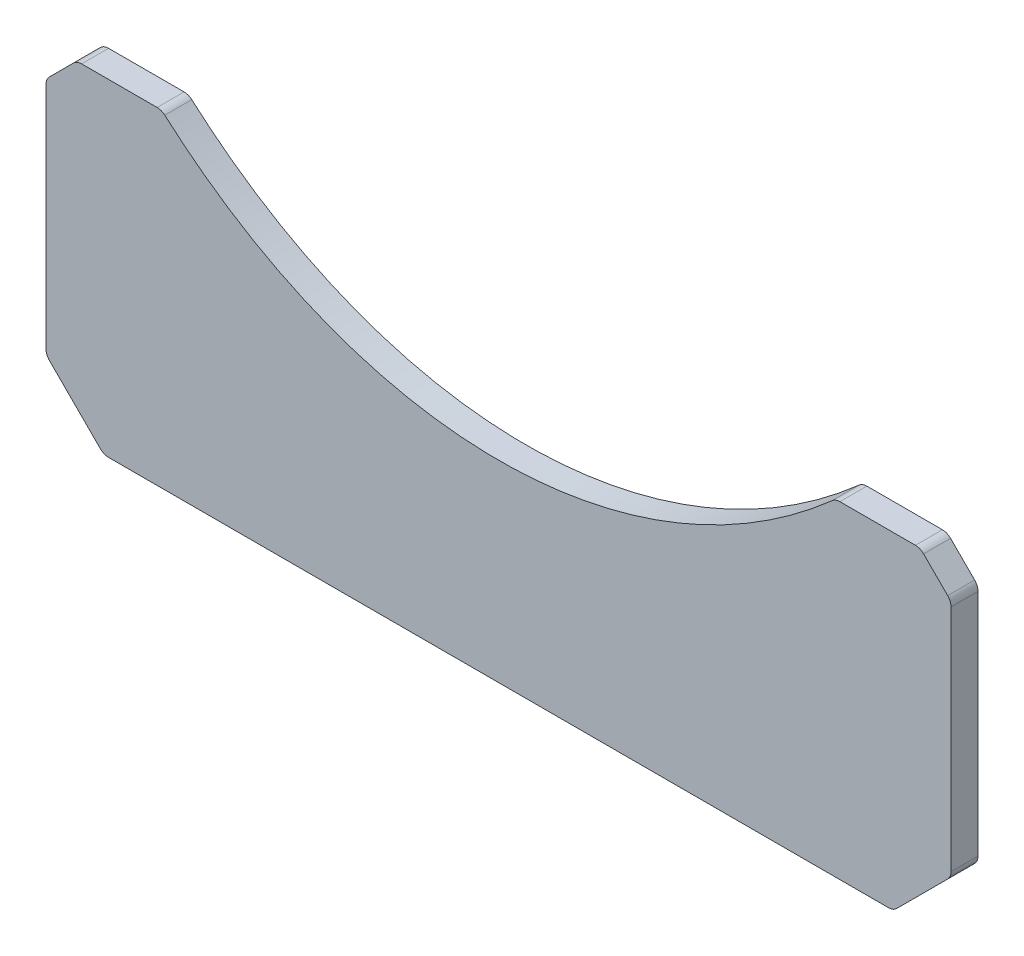
ISO-10303-21;
HEADER;
FILE_DESCRIPTION(('STEP AP214'),'2;1');
FILE_NAME('part.step','',(''),(''),'','','');
FILE_SCHEMA(('AUTOMOTIVE_DESIGN { 1 0 10303 214 1 1 1 1 }'));
ENDSEC;
DATA;
#1=APPLICATION_CONTEXT('core data for automotive mechanical design processes');
#2=APPLICATION_PROTOCOL_DEFINITION('international standard','automotive_design',2000,#1);
#3=PRODUCT_CONTEXT('',#1,'mechanical');
#4=PRODUCT('Part','Part','',(#3));
#5=PRODUCT_RELATED_PRODUCT_CATEGORY('part','',(#4));
#6=PRODUCT_DEFINITION_FORMATION('','',#4);
#7=PRODUCT_DEFINITION_CONTEXT('part definition',#1,'design');
#8=PRODUCT_DEFINITION('design','',#6,#7);
#9=PRODUCT_DEFINITION_SHAPE('','',#8);
#10=(LENGTH_UNIT() NAMED_UNIT(*) SI_UNIT(.MILLI.,.METRE.));
#11=(NAMED_UNIT(*) PLANE_ANGLE_UNIT() SI_UNIT($,.RADIAN.));
#12=(NAMED_UNIT(*) SI_UNIT($,.STERADIAN.) SOLID_ANGLE_UNIT());
#13=UNCERTAINTY_MEASURE_WITH_UNIT(LENGTH_MEASURE(1.E-05),#10,'distance_accuracy_value','');
#14=(GEOMETRIC_REPRESENTATION_CONTEXT(3) GLOBAL_UNCERTAINTY_ASSIGNED_CONTEXT((#13)) GLOBAL_UNIT_ASSIGNED_CONTEXT((#10,
#11,#12)) REPRESENTATION_CONTEXT('',''));
#15=CARTESIAN_POINT('',(0.,0.,0.));
#16=DIRECTION('',(0.,0.,1.));
#17=DIRECTION('',(1.,0.,0.));
#18=AXIS2_PLACEMENT_3D('',#15,#16,#17);
#19=CARTESIAN_POINT('',(102.5,0.,7.));
#20=DIRECTION('',(-0.707106781186548,0.707106781186547,0.));
#21=DIRECTION('',(-0.707106781186547,-0.707106781186548,0.));
#22=AXIS2_PLACEMENT_3D('',#19,#20,#21);
#23=PLANE('',#22);
#24=DIRECTION('',(0.707106781186547,0.707106781186548,0.));
#25=VECTOR('',#24,1.);
#26=CARTESIAN_POINT('',(102.5,0.,7.));
#27=LINE('',#26,#25);
#28=CARTESIAN_POINT('',(103.37867965644,0.878679656440354,7.));
#29=VERTEX_POINT('',#28);
#30=CARTESIAN_POINT('',(116.62132034356,14.1213203435596,7.));
#31=VERTEX_POINT('',#30);
#32=EDGE_CURVE('E230',#29,#31,#27,.T.);
#33=ORIENTED_EDGE('',*,*,#32,.F.);
#34=DIRECTION('',(0.,0.,-1.));
#35=VECTOR('',#34,1.);
#36=CARTESIAN_POINT('',(103.37867965644,0.878679656440354,7.));
#37=LINE('',#36,#35);
#38=CARTESIAN_POINT('',(103.37867965644,0.878679656440354,0.));
#39=VERTEX_POINT('',#38);
#40=EDGE_CURVE('E302',#29,#39,#37,.T.);
#41=ORIENTED_EDGE('',*,*,#40,.T.);
#42=DIRECTION('',(0.707106781186547,0.707106781186548,0.));
#43=VECTOR('',#42,1.);
#44=CARTESIAN_POINT('',(102.5,0.,0.));
#45=LINE('',#44,#43);
#46=CARTESIAN_POINT('',(116.62132034356,14.1213203435596,0.));
#47=VERTEX_POINT('',#46);
#48=EDGE_CURVE('E210',#39,#47,#45,.T.);
#49=ORIENTED_EDGE('',*,*,#48,.T.);
#50=DIRECTION('',(0.,0.,-1.));
#51=VECTOR('',#50,1.);
#52=CARTESIAN_POINT('',(116.62132034356,14.1213203435596,7.));
#53=LINE('',#52,#51);
#54=EDGE_CURVE('E300',#47,#31,#53,.F.);
#55=ORIENTED_EDGE('',*,*,#54,.T.);
#56=EDGE_LOOP('',(#33,#41,#49,#55));
#57=FACE_BOUND('',#56,.T.);
#58=ADVANCED_FACE('F39',(#57),#23,.F.);
#59=CARTESIAN_POINT('',(117.5,15.,7.));
#60=DIRECTION('',(-1.,0.,0.));
#61=DIRECTION('',(0.,0.,1.));
#62=AXIS2_PLACEMENT_3D('',#59,#60,#61);
#63=PLANE('',#62);
#64=DIRECTION('',(0.,1.,0.));
#65=VECTOR('',#64,1.);
#66=CARTESIAN_POINT('',(117.5,15.,0.));
#67=LINE('',#66,#65);
#68=CARTESIAN_POINT('',(117.5,16.2426406871193,0.));
#69=VERTEX_POINT('',#68);
#70=CARTESIAN_POINT('',(117.5,75.7573593128807,0.));
#71=VERTEX_POINT('',#70);
#72=EDGE_CURVE('E205',#69,#71,#67,.T.);
#73=ORIENTED_EDGE('',*,*,#72,.T.);
#74=DIRECTION('',(0.,0.,-1.));
#75=VECTOR('',#74,1.);
#76=CARTESIAN_POINT('',(117.5,75.7573593128807,7.));
#77=LINE('',#76,#75);
#78=CARTESIAN_POINT('',(117.5,75.7573593128807,7.));
#79=VERTEX_POINT('',#78);
#80=EDGE_CURVE('E183',#71,#79,#77,.F.);
#81=ORIENTED_EDGE('',*,*,#80,.T.);
#82=DIRECTION('',(0.,1.,0.));
#83=VECTOR('',#82,1.);
#84=CARTESIAN_POINT('',(117.5,15.,7.));
#85=LINE('',#84,#83);
#86=CARTESIAN_POINT('',(117.5,16.2426406871193,7.));
#87=VERTEX_POINT('',#86);
#88=EDGE_CURVE('E360',#87,#79,#85,.T.);
#89=ORIENTED_EDGE('',*,*,#88,.F.);
#90=DIRECTION('',(0.,0.,-1.));
#91=VECTOR('',#90,1.);
#92=CARTESIAN_POINT('',(117.5,16.2426406871193,7.));
#93=LINE('',#92,#91);
#94=EDGE_CURVE('E188',#87,#69,#93,.T.);
#95=ORIENTED_EDGE('',*,*,#94,.T.);
#96=EDGE_LOOP('',(#73,#81,#89,#95));
#97=FACE_BOUND('',#96,.T.);
#98=ADVANCED_FACE('F362',(#97),#63,.F.);
#99=CARTESIAN_POINT('',(117.5,77.,7.));
#100=DIRECTION('',(-0.707106781186546,-0.707106781186549,0.));
#101=DIRECTION('',(0.707106781186549,-0.707106781186546,0.));
#102=AXIS2_PLACEMENT_3D('',#99,#100,#101);
#103=PLANE('',#102);
#104=DIRECTION('',(-0.707106781186549,0.707106781186546,0.));
#105=VECTOR('',#104,1.);
#106=CARTESIAN_POINT('',(117.5,77.,7.));
#107=LINE('',#106,#105);
#108=CARTESIAN_POINT('',(116.62132034356,77.8786796564404,7.));
#109=VERTEX_POINT('',#108);
#110=CARTESIAN_POINT('',(110.37867965644,84.1213203435596,7.));
#111=VERTEX_POINT('',#110);
#112=EDGE_CURVE('E198',#109,#111,#107,.T.);
#113=ORIENTED_EDGE('',*,*,#112,.F.);
#114=DIRECTION('',(0.,0.,-1.));
#115=VECTOR('',#114,1.);
#116=CARTESIAN_POINT('',(116.62132034356,77.8786796564404,7.));
#117=LINE('',#116,#115);
#118=CARTESIAN_POINT('',(116.62132034356,77.8786796564404,0.));
#119=VERTEX_POINT('',#118);
#120=EDGE_CURVE('E182',#109,#119,#117,.T.);
#121=ORIENTED_EDGE('',*,*,#120,.T.);
#122=DIRECTION('',(-0.707106781186549,0.707106781186546,0.));
#123=VECTOR('',#122,1.);
#124=CARTESIAN_POINT('',(117.5,77.,0.));
#125=LINE('',#124,#123);
#126=CARTESIAN_POINT('',(110.37867965644,84.1213203435596,0.));
#127=VERTEX_POINT('',#126);
#128=EDGE_CURVE('E195',#119,#127,#125,.T.);
#129=ORIENTED_EDGE('',*,*,#128,.T.);
#130=DIRECTION('',(0.,0.,-1.));
#131=VECTOR('',#130,1.);
#132=CARTESIAN_POINT('',(110.37867965644,84.1213203435596,7.));
#133=LINE('',#132,#131);
#134=EDGE_CURVE('E200',#127,#111,#133,.F.);
#135=ORIENTED_EDGE('',*,*,#134,.T.);
#136=EDGE_LOOP('',(#113,#121,#129,#135));
#137=FACE_BOUND('',#136,.T.);
#138=ADVANCED_FACE('F194',(#137),#103,.F.);
#139=CARTESIAN_POINT('',(109.5,85.,7.));
#140=DIRECTION('',(0.,-1.,0.));
#141=DIRECTION('',(1.,0.,0.));
#142=AXIS2_PLACEMENT_3D('',#139,#140,#141);
#143=PLANE('',#142);
#144=DIRECTION('',(-1.,0.,0.));
#145=VECTOR('',#144,1.);
#146=CARTESIAN_POINT('',(109.5,85.,7.));
#147=LINE('',#146,#145);
#148=CARTESIAN_POINT('',(108.257359312881,85.,7.));
#149=VERTEX_POINT('',#148);
#150=CARTESIAN_POINT('',(88.6415544527192,85.,7.));
#151=VERTEX_POINT('',#150);
#152=EDGE_CURVE('E321',#149,#151,#147,.T.);
#153=ORIENTED_EDGE('',*,*,#152,.F.);
#154=DIRECTION('',(0.,0.,-1.));
#155=VECTOR('',#154,1.);
#156=CARTESIAN_POINT('',(108.257359312881,85.,7.));
#157=LINE('',#156,#155);
#158=CARTESIAN_POINT('',(108.257359312881,85.,0.));
#159=VERTEX_POINT('',#158);
#160=EDGE_CURVE('E273',#149,#159,#157,.T.);
#161=ORIENTED_EDGE('',*,*,#160,.T.);
#162=DIRECTION('',(-1.,0.,0.));
#163=VECTOR('',#162,1.);
#164=CARTESIAN_POINT('',(109.5,85.,0.));
#165=LINE('',#164,#163);
#166=CARTESIAN_POINT('',(88.6415544527192,85.,0.));
#167=VERTEX_POINT('',#166);
#168=EDGE_CURVE('E204',#159,#167,#165,.T.);
#169=ORIENTED_EDGE('',*,*,#168,.T.);
#170=DIRECTION('',(0.,0.,-1.));
#171=VECTOR('',#170,1.);
#172=CARTESIAN_POINT('',(88.6415544527192,85.,7.));
#173=LINE('',#172,#171);
#174=EDGE_CURVE('E271',#167,#151,#173,.F.);
#175=ORIENTED_EDGE('',*,*,#174,.T.);
#176=EDGE_LOOP('',(#153,#161,#169,#175));
#177=FACE_BOUND('',#176,.T.);
#178=ADVANCED_FACE('F372',(#177),#143,.F.);
#179=CARTESIAN_POINT('',(0.,230.,7.));
#180=DIRECTION('',(0.,0.,-1.));
#181=DIRECTION('',(0.,1.,0.));
#182=AXIS2_PLACEMENT_3D('',#179,#180,#181);
#183=ELLIPSE('',#182,180.,147.674277745626);
#184=DIRECTION('',(0.,0.,-1.));
#185=VECTOR('',#184,1.);
#186=SURFACE_OF_LINEAR_EXTRUSION('',#183,#185);
#187=CARTESIAN_POINT('',(86.6554673419255,84.2484345639443,7.));
#188=VERTEX_POINT('',#187);
#189=CARTESIAN_POINT('',(-86.6554673419256,84.2484345639443,7.));
#190=VERTEX_POINT('',#189);
#191=EDGE_CURVE('E309',#188,#190,#183,.T.);
#192=ORIENTED_EDGE('',*,*,#191,.F.);
#193=DIRECTION('',(0.,0.,-1.));
#194=VECTOR('',#193,1.);
#195=CARTESIAN_POINT('',(86.6554673419255,84.2484345639443,7.));
#196=LINE('',#195,#194);
#197=CARTESIAN_POINT('',(86.6554673419255,84.2484345639443,0.));
#198=VERTEX_POINT('',#197);
#199=EDGE_CURVE('E11',#188,#198,#196,.T.);
#200=ORIENTED_EDGE('',*,*,#199,.T.);
#201=CARTESIAN_POINT('',(0.,230.,0.));
#202=DIRECTION('',(0.,0.,-1.));
#203=DIRECTION('',(0.,1.,0.));
#204=AXIS2_PLACEMENT_3D('',#201,#202,#203);
#205=ELLIPSE('',#204,180.,147.674277745626);
#206=CARTESIAN_POINT('',(-86.6554673419256,84.2484345639443,0.));
#207=VERTEX_POINT('',#206);
#208=EDGE_CURVE('E208',#198,#207,#205,.T.);
#209=ORIENTED_EDGE('',*,*,#208,.T.);
#210=DIRECTION('',(0.,0.,-1.));
#211=VECTOR('',#210,1.);
#212=CARTESIAN_POINT('',(-86.6554673419256,84.2484345639443,0.));
#213=LINE('',#212,#211);
#214=EDGE_CURVE('E47',#207,#190,#213,.F.);
#215=ORIENTED_EDGE('',*,*,#214,.T.);
#216=EDGE_LOOP('',(#192,#200,#209,#215));
#217=FACE_BOUND('',#216,.T.);
#218=ADVANCED_FACE('F308',(#217),#186,.F.);
#219=CARTESIAN_POINT('',(-109.5,85.,7.));
#220=DIRECTION('',(0.,-1.,0.));
#221=DIRECTION('',(1.,0.,0.));
#222=AXIS2_PLACEMENT_3D('',#219,#220,#221);
#223=PLANE('',#222);
#224=DIRECTION('',(-1.,0.,0.));
#225=VECTOR('',#224,1.);
#226=CARTESIAN_POINT('',(-109.5,85.,0.));
#227=LINE('',#226,#225);
#228=CARTESIAN_POINT('',(-88.6415544527192,85.,0.));
#229=VERTEX_POINT('',#228);
#230=CARTESIAN_POINT('',(-108.257359312881,85.,0.));
#231=VERTEX_POINT('',#230);
#232=EDGE_CURVE('E216',#229,#231,#227,.T.);
#233=ORIENTED_EDGE('',*,*,#232,.T.);
#234=DIRECTION('',(0.,0.,-1.));
#235=VECTOR('',#234,1.);
#236=CARTESIAN_POINT('',(-108.257359312881,85.,7.));
#237=LINE('',#236,#235);
#238=CARTESIAN_POINT('',(-108.257359312881,85.,7.));
#239=VERTEX_POINT('',#238);
#240=EDGE_CURVE('E284',#231,#239,#237,.F.);
#241=ORIENTED_EDGE('',*,*,#240,.T.);
#242=DIRECTION('',(-1.,0.,0.));
#243=VECTOR('',#242,1.);
#244=CARTESIAN_POINT('',(-109.5,85.,7.));
#245=LINE('',#244,#243);
#246=CARTESIAN_POINT('',(-88.6415544527192,85.,7.));
#247=VERTEX_POINT('',#246);
#248=EDGE_CURVE('E320',#247,#239,#245,.T.);
#249=ORIENTED_EDGE('',*,*,#248,.F.);
#250=DIRECTION('',(0.,0.,-1.));
#251=VECTOR('',#250,1.);
#252=CARTESIAN_POINT('',(-88.6415544527192,85.,7.));
#253=LINE('',#252,#251);
#254=EDGE_CURVE('E281',#247,#229,#253,.T.);
#255=ORIENTED_EDGE('',*,*,#254,.T.);
#256=EDGE_LOOP('',(#233,#241,#249,#255));
#257=FACE_BOUND('',#256,.T.);
#258=ADVANCED_FACE('F326',(#257),#223,.F.);
#259=CARTESIAN_POINT('',(-117.5,77.,7.));
#260=DIRECTION('',(0.707106781186547,-0.707106781186548,0.));
#261=DIRECTION('',(0.707106781186548,0.707106781186547,0.));
#262=AXIS2_PLACEMENT_3D('',#259,#260,#261);
#263=PLANE('',#262);
#264=DIRECTION('',(-0.707106781186548,-0.707106781186547,0.));
#265=VECTOR('',#264,1.);
#266=CARTESIAN_POINT('',(-117.5,77.,7.));
#267=LINE('',#266,#265);
#268=CARTESIAN_POINT('',(-110.37867965644,84.1213203435596,7.));
#269=VERTEX_POINT('',#268);
#270=CARTESIAN_POINT('',(-116.62132034356,77.8786796564404,7.));
#271=VERTEX_POINT('',#270);
#272=EDGE_CURVE('E338',#269,#271,#267,.T.);
#273=ORIENTED_EDGE('',*,*,#272,.F.);
#274=DIRECTION('',(0.,0.,-1.));
#275=VECTOR('',#274,1.);
#276=CARTESIAN_POINT('',(-110.37867965644,84.1213203435596,7.));
#277=LINE('',#276,#275);
#278=CARTESIAN_POINT('',(-110.37867965644,84.1213203435596,0.));
#279=VERTEX_POINT('',#278);
#280=EDGE_CURVE('E278',#269,#279,#277,.T.);
#281=ORIENTED_EDGE('',*,*,#280,.T.);
#282=DIRECTION('',(-0.707106781186548,-0.707106781186547,0.));
#283=VECTOR('',#282,1.);
#284=CARTESIAN_POINT('',(-117.5,77.,0.));
#285=LINE('',#284,#283);
#286=CARTESIAN_POINT('',(-116.62132034356,77.8786796564404,0.));
#287=VERTEX_POINT('',#286);
#288=EDGE_CURVE('E219',#279,#287,#285,.T.);
#289=ORIENTED_EDGE('',*,*,#288,.T.);
#290=DIRECTION('',(0.,0.,-1.));
#291=VECTOR('',#290,1.);
#292=CARTESIAN_POINT('',(-116.62132034356,77.8786796564404,7.));
#293=LINE('',#292,#291);
#294=EDGE_CURVE('E276',#287,#271,#293,.F.);
#295=ORIENTED_EDGE('',*,*,#294,.T.);
#296=EDGE_LOOP('',(#273,#281,#289,#295));
#297=FACE_BOUND('',#296,.T.);
#298=ADVANCED_FACE('F335',(#297),#263,.F.);
#299=CARTESIAN_POINT('',(-117.5,15.,7.));
#300=DIRECTION('',(1.,0.,0.));
#301=DIRECTION('',(0.,0.,-1.));
#302=AXIS2_PLACEMENT_3D('',#299,#300,#301);
#303=PLANE('',#302);
#304=DIRECTION('',(0.,-1.,0.));
#305=VECTOR('',#304,1.);
#306=CARTESIAN_POINT('',(-117.5,15.,7.));
#307=LINE('',#306,#305);
#308=CARTESIAN_POINT('',(-117.5,75.7573593128807,7.));
#309=VERTEX_POINT('',#308);
#310=CARTESIAN_POINT('',(-117.5,16.2426406871193,7.));
#311=VERTEX_POINT('',#310);
#312=EDGE_CURVE('E340',#309,#311,#307,.T.);
#313=ORIENTED_EDGE('',*,*,#312,.F.);
#314=DIRECTION('',(0.,0.,-1.));
#315=VECTOR('',#314,1.);
#316=CARTESIAN_POINT('',(-117.5,75.7573593128807,7.));
#317=LINE('',#316,#315);
#318=CARTESIAN_POINT('',(-117.5,75.7573593128807,0.));
#319=VERTEX_POINT('',#318);
#320=EDGE_CURVE('E288',#309,#319,#317,.T.);
#321=ORIENTED_EDGE('',*,*,#320,.T.);
#322=DIRECTION('',(0.,-1.,0.));
#323=VECTOR('',#322,1.);
#324=CARTESIAN_POINT('',(-117.5,15.,0.));
#325=LINE('',#324,#323);
#326=CARTESIAN_POINT('',(-117.5,16.2426406871193,0.));
#327=VERTEX_POINT('',#326);
#328=EDGE_CURVE('E222',#319,#327,#325,.T.);
#329=ORIENTED_EDGE('',*,*,#328,.T.);
#330=DIRECTION('',(0.,0.,-1.));
#331=VECTOR('',#330,1.);
#332=CARTESIAN_POINT('',(-117.5,16.2426406871193,7.));
#333=LINE('',#332,#331);
#334=EDGE_CURVE('E286',#327,#311,#333,.F.);
#335=ORIENTED_EDGE('',*,*,#334,.T.);
#336=EDGE_LOOP('',(#313,#321,#329,#335));
#337=FACE_BOUND('',#336,.T.);
#338=ADVANCED_FACE('F481',(#337),#303,.F.);
#339=CARTESIAN_POINT('',(-102.5,0.,7.));
#340=DIRECTION('',(0.707106781186548,0.707106781186547,0.));
#341=DIRECTION('',(-0.707106781186547,0.707106781186548,0.));
#342=AXIS2_PLACEMENT_3D('',#339,#340,#341);
#343=PLANE('',#342);
#344=DIRECTION('',(0.707106781186547,-0.707106781186548,0.));
#345=VECTOR('',#344,1.);
#346=CARTESIAN_POINT('',(-102.5,0.,7.));
#347=LINE('',#346,#345);
#348=CARTESIAN_POINT('',(-116.62132034356,14.1213203435596,7.));
#349=VERTEX_POINT('',#348);
#350=CARTESIAN_POINT('',(-103.37867965644,0.878679656440354,7.));
#351=VERTEX_POINT('',#350);
#352=EDGE_CURVE('E343',#349,#351,#347,.T.);
#353=ORIENTED_EDGE('',*,*,#352,.F.);
#354=DIRECTION('',(0.,0.,-1.));
#355=VECTOR('',#354,1.);
#356=CARTESIAN_POINT('',(-116.62132034356,14.1213203435596,7.));
#357=LINE('',#356,#355);
#358=CARTESIAN_POINT('',(-116.62132034356,14.1213203435596,0.));
#359=VERTEX_POINT('',#358);
#360=EDGE_CURVE('E293',#349,#359,#357,.T.);
#361=ORIENTED_EDGE('',*,*,#360,.T.);
#362=DIRECTION('',(0.707106781186547,-0.707106781186548,0.));
#363=VECTOR('',#362,1.);
#364=CARTESIAN_POINT('',(-102.5,0.,0.));
#365=LINE('',#364,#363);
#366=CARTESIAN_POINT('',(-103.37867965644,0.878679656440354,0.));
#367=VERTEX_POINT('',#366);
#368=EDGE_CURVE('E225',#359,#367,#365,.T.);
#369=ORIENTED_EDGE('',*,*,#368,.T.);
#370=DIRECTION('',(0.,0.,-1.));
#371=VECTOR('',#370,1.);
#372=CARTESIAN_POINT('',(-103.37867965644,0.878679656440354,7.));
#373=LINE('',#372,#371);
#374=EDGE_CURVE('E291',#367,#351,#373,.F.);
#375=ORIENTED_EDGE('',*,*,#374,.T.);
#376=EDGE_LOOP('',(#353,#361,#369,#375));
#377=FACE_BOUND('',#376,.T.);
#378=ADVANCED_FACE('F474',(#377),#343,.F.);
#379=CARTESIAN_POINT('',(-102.5,0.,7.));
#380=DIRECTION('',(0.,1.,0.));
#381=DIRECTION('',(0.,0.,1.));
#382=AXIS2_PLACEMENT_3D('',#379,#380,#381);
#383=PLANE('',#382);
#384=DIRECTION('',(1.,0.,0.));
#385=VECTOR('',#384,1.);
#386=CARTESIAN_POINT('',(-102.5,0.,7.));
#387=LINE('',#386,#385);
#388=CARTESIAN_POINT('',(-101.257359312881,0.,7.));
#389=VERTEX_POINT('',#388);
#390=CARTESIAN_POINT('',(101.257359312881,0.,7.));
#391=VERTEX_POINT('',#390);
#392=EDGE_CURVE('E231',#389,#391,#387,.T.);
#393=ORIENTED_EDGE('',*,*,#392,.F.);
#394=DIRECTION('',(0.,0.,-1.));
#395=VECTOR('',#394,1.);
#396=CARTESIAN_POINT('',(-101.257359312881,0.,7.));
#397=LINE('',#396,#395);
#398=CARTESIAN_POINT('',(-101.257359312881,0.,0.));
#399=VERTEX_POINT('',#398);
#400=EDGE_CURVE('E297',#389,#399,#397,.T.);
#401=ORIENTED_EDGE('',*,*,#400,.T.);
#402=DIRECTION('',(1.,0.,0.));
#403=VECTOR('',#402,1.);
#404=CARTESIAN_POINT('',(-102.5,0.,0.));
#405=LINE('',#404,#403);
#406=CARTESIAN_POINT('',(101.257359312881,0.,0.));
#407=VERTEX_POINT('',#406);
#408=EDGE_CURVE('E228',#399,#407,#405,.T.);
#409=ORIENTED_EDGE('',*,*,#408,.T.);
#410=DIRECTION('',(0.,0.,-1.));
#411=VECTOR('',#410,1.);
#412=CARTESIAN_POINT('',(101.257359312881,0.,7.));
#413=LINE('',#412,#411);
#414=EDGE_CURVE('E54',#407,#391,#413,.F.);
#415=ORIENTED_EDGE('',*,*,#414,.T.);
#416=EDGE_LOOP('',(#393,#401,#409,#415));
#417=FACE_BOUND('',#416,.T.);
#418=ADVANCED_FACE('F467',(#417),#383,.F.);
#419=CARTESIAN_POINT('',(0.,230.,7.));
#420=DIRECTION('',(0.,0.,-1.));
#421=DIRECTION('',(-1.,0.,0.));
#422=AXIS2_PLACEMENT_3D('',#419,#420,#421);
#423=PLANE('',#422);
#424=ORIENTED_EDGE('',*,*,#88,.T.);
#425=CARTESIAN_POINT('',(114.5,75.7573593128807,7.));
#426=DIRECTION('',(0.,0.,-1.));
#427=DIRECTION('',(-1.,0.,0.));
#428=AXIS2_PLACEMENT_3D('',#425,#426,#427);
#429=CIRCLE('',#428,3.);
#430=EDGE_CURVE('E269',#79,#109,#429,.F.);
#431=ORIENTED_EDGE('',*,*,#430,.T.);
#432=ORIENTED_EDGE('',*,*,#112,.T.);
#433=CARTESIAN_POINT('',(108.257359312881,82.,7.));
#434=DIRECTION('',(0.,0.,-1.));
#435=DIRECTION('',(-1.,0.,0.));
#436=AXIS2_PLACEMENT_3D('',#433,#434,#435);
#437=CIRCLE('',#436,3.);
#438=EDGE_CURVE('E267',#111,#149,#437,.F.);
#439=ORIENTED_EDGE('',*,*,#438,.T.);
#440=ORIENTED_EDGE('',*,*,#152,.T.);
#441=CARTESIAN_POINT('',(88.6415544527192,82.,7.));
#442=DIRECTION('',(0.,0.,-1.));
#443=DIRECTION('',(-1.,0.,0.));
#444=AXIS2_PLACEMENT_3D('',#441,#442,#443);
#445=CIRCLE('',#444,3.);
#446=EDGE_CURVE('E254',#151,#188,#445,.F.);
#447=ORIENTED_EDGE('',*,*,#446,.T.);
#448=ORIENTED_EDGE('',*,*,#191,.T.);
#449=CARTESIAN_POINT('',(-88.6415544527192,82.0000000000001,7.));
#450=DIRECTION('',(0.,0.,-1.));
#451=DIRECTION('',(-1.,0.,0.));
#452=AXIS2_PLACEMENT_3D('',#449,#450,#451);
#453=CIRCLE('',#452,3.);
#454=EDGE_CURVE('E252',#190,#247,#453,.F.);
#455=ORIENTED_EDGE('',*,*,#454,.T.);
#456=ORIENTED_EDGE('',*,*,#248,.T.);
#457=CARTESIAN_POINT('',(-108.257359312881,82.,7.));
#458=DIRECTION('',(0.,0.,-1.));
#459=DIRECTION('',(-1.,0.,0.));
#460=AXIS2_PLACEMENT_3D('',#457,#458,#459);
#461=CIRCLE('',#460,3.);
#462=EDGE_CURVE('E265',#239,#269,#461,.F.);
#463=ORIENTED_EDGE('',*,*,#462,.T.);
#464=ORIENTED_EDGE('',*,*,#272,.T.);
#465=CARTESIAN_POINT('',(-114.5,75.7573593128807,7.));
#466=DIRECTION('',(0.,0.,-1.));
#467=DIRECTION('',(-1.,0.,0.));
#468=AXIS2_PLACEMENT_3D('',#465,#466,#467);
#469=CIRCLE('',#468,3.);
#470=EDGE_CURVE('E263',#271,#309,#469,.F.);
#471=ORIENTED_EDGE('',*,*,#470,.T.);
#472=ORIENTED_EDGE('',*,*,#312,.T.);
#473=CARTESIAN_POINT('',(-114.5,16.2426406871193,7.));
#474=DIRECTION('',(0.,0.,-1.));
#475=DIRECTION('',(-1.,0.,0.));
#476=AXIS2_PLACEMENT_3D('',#473,#474,#475);
#477=CIRCLE('',#476,3.);
#478=EDGE_CURVE('E261',#311,#349,#477,.F.);
#479=ORIENTED_EDGE('',*,*,#478,.T.);
#480=ORIENTED_EDGE('',*,*,#352,.T.);
#481=CARTESIAN_POINT('',(-101.257359312881,3.,7.));
#482=DIRECTION('',(0.,0.,-1.));
#483=DIRECTION('',(-1.,0.,0.));
#484=AXIS2_PLACEMENT_3D('',#481,#482,#483);
#485=CIRCLE('',#484,3.);
#486=EDGE_CURVE('E61',#351,#389,#485,.F.);
#487=ORIENTED_EDGE('',*,*,#486,.T.);
#488=ORIENTED_EDGE('',*,*,#392,.T.);
#489=CARTESIAN_POINT('',(101.257359312881,3.,7.));
#490=DIRECTION('',(0.,0.,-1.));
#491=DIRECTION('',(-1.,0.,0.));
#492=AXIS2_PLACEMENT_3D('',#489,#490,#491);
#493=CIRCLE('',#492,3.);
#494=EDGE_CURVE('E258',#391,#29,#493,.F.);
#495=ORIENTED_EDGE('',*,*,#494,.T.);
#496=ORIENTED_EDGE('',*,*,#32,.T.);
#497=CARTESIAN_POINT('',(114.5,16.2426406871193,7.));
#498=DIRECTION('',(0.,0.,-1.));
#499=DIRECTION('',(-1.,0.,0.));
#500=AXIS2_PLACEMENT_3D('',#497,#498,#499);
#501=CIRCLE('',#500,3.);
#502=EDGE_CURVE('E256',#31,#87,#501,.F.);
#503=ORIENTED_EDGE('',*,*,#502,.T.);
#504=EDGE_LOOP('',(#424,#431,#432,#439,#440,#447,#448,#455,#456,#463,#464,#471,#472,#479,#480,
#487,#488,#495,#496,#503));
#505=FACE_BOUND('',#504,.T.);
#506=ADVANCED_FACE('F315',(#505),#423,.F.);
#507=CARTESIAN_POINT('',(0.,230.,0.));
#508=DIRECTION('',(0.,0.,-1.));
#509=DIRECTION('',(-1.,0.,0.));
#510=AXIS2_PLACEMENT_3D('',#507,#508,#509);
#511=PLANE('',#510);
#512=ORIENTED_EDGE('',*,*,#128,.F.);
#513=CARTESIAN_POINT('',(114.5,75.7573593128807,0.));
#514=DIRECTION('',(0.,0.,-1.));
#515=DIRECTION('',(-1.,0.,0.));
#516=AXIS2_PLACEMENT_3D('',#513,#514,#515);
#517=CIRCLE('',#516,3.);
#518=EDGE_CURVE('E178',#119,#71,#517,.T.);
#519=ORIENTED_EDGE('',*,*,#518,.T.);
#520=ORIENTED_EDGE('',*,*,#72,.F.);
#521=CARTESIAN_POINT('',(114.5,16.2426406871193,0.));
#522=DIRECTION('',(0.,0.,-1.));
#523=DIRECTION('',(-1.,0.,0.));
#524=AXIS2_PLACEMENT_3D('',#521,#522,#523);
#525=CIRCLE('',#524,3.);
#526=EDGE_CURVE('E236',#69,#47,#525,.T.);
#527=ORIENTED_EDGE('',*,*,#526,.T.);
#528=ORIENTED_EDGE('',*,*,#48,.F.);
#529=CARTESIAN_POINT('',(101.257359312881,3.,0.));
#530=DIRECTION('',(0.,0.,-1.));
#531=DIRECTION('',(-1.,0.,0.));
#532=AXIS2_PLACEMENT_3D('',#529,#530,#531);
#533=CIRCLE('',#532,3.);
#534=EDGE_CURVE('E238',#39,#407,#533,.T.);
#535=ORIENTED_EDGE('',*,*,#534,.T.);
#536=ORIENTED_EDGE('',*,*,#408,.F.);
#537=CARTESIAN_POINT('',(-101.257359312881,3.,0.));
#538=DIRECTION('',(0.,0.,-1.));
#539=DIRECTION('',(-1.,0.,0.));
#540=AXIS2_PLACEMENT_3D('',#537,#538,#539);
#541=CIRCLE('',#540,3.);
#542=EDGE_CURVE('E240',#399,#367,#541,.T.);
#543=ORIENTED_EDGE('',*,*,#542,.T.);
#544=ORIENTED_EDGE('',*,*,#368,.F.);
#545=CARTESIAN_POINT('',(-114.5,16.2426406871193,0.));
#546=DIRECTION('',(0.,0.,-1.));
#547=DIRECTION('',(-1.,0.,0.));
#548=AXIS2_PLACEMENT_3D('',#545,#546,#547);
#549=CIRCLE('',#548,3.);
#550=EDGE_CURVE('E242',#359,#327,#549,.T.);
#551=ORIENTED_EDGE('',*,*,#550,.T.);
#552=ORIENTED_EDGE('',*,*,#328,.F.);
#553=CARTESIAN_POINT('',(-114.5,75.7573593128807,0.));
#554=DIRECTION('',(0.,0.,-1.));
#555=DIRECTION('',(-1.,0.,0.));
#556=AXIS2_PLACEMENT_3D('',#553,#554,#555);
#557=CIRCLE('',#556,3.);
#558=EDGE_CURVE('E244',#319,#287,#557,.T.);
#559=ORIENTED_EDGE('',*,*,#558,.T.);
#560=ORIENTED_EDGE('',*,*,#288,.F.);
#561=CARTESIAN_POINT('',(-108.257359312881,82.,0.));
#562=DIRECTION('',(0.,0.,-1.));
#563=DIRECTION('',(-1.,0.,0.));
#564=AXIS2_PLACEMENT_3D('',#561,#562,#563);
#565=CIRCLE('',#564,3.);
#566=EDGE_CURVE('E246',#279,#231,#565,.T.);
#567=ORIENTED_EDGE('',*,*,#566,.T.);
#568=ORIENTED_EDGE('',*,*,#232,.F.);
#569=CARTESIAN_POINT('',(-88.6415544527192,82.0000000000001,0.));
#570=DIRECTION('',(0.,0.,-1.));
#571=DIRECTION('',(-1.,0.,0.));
#572=AXIS2_PLACEMENT_3D('',#569,#570,#571);
#573=CIRCLE('',#572,3.);
#574=EDGE_CURVE('E199',#229,#207,#573,.T.);
#575=ORIENTED_EDGE('',*,*,#574,.T.);
#576=ORIENTED_EDGE('',*,*,#208,.F.);
#577=CARTESIAN_POINT('',(88.6415544527192,82.,0.));
#578=DIRECTION('',(0.,0.,-1.));
#579=DIRECTION('',(-1.,0.,0.));
#580=AXIS2_PLACEMENT_3D('',#577,#578,#579);
#581=CIRCLE('',#580,3.);
#582=EDGE_CURVE('E234',#198,#167,#581,.T.);
#583=ORIENTED_EDGE('',*,*,#582,.T.);
#584=ORIENTED_EDGE('',*,*,#168,.F.);
#585=CARTESIAN_POINT('',(108.257359312881,82.,0.));
#586=DIRECTION('',(0.,0.,-1.));
#587=DIRECTION('',(-1.,0.,0.));
#588=AXIS2_PLACEMENT_3D('',#585,#586,#587);
#589=CIRCLE('',#588,3.);
#590=EDGE_CURVE('E189',#159,#127,#589,.T.);
#591=ORIENTED_EDGE('',*,*,#590,.T.);
#592=EDGE_LOOP('',(#512,#519,#520,#527,#528,#535,#536,#543,#544,#551,#552,#559,#560,#567,#568,
#575,#576,#583,#584,#591));
#593=FACE_BOUND('',#592,.T.);
#594=ADVANCED_FACE('F202',(#593),#511,.T.);
#595=CARTESIAN_POINT('',(114.5,75.7573593128807,7.));
#596=DIRECTION('',(0.,0.,-1.));
#597=DIRECTION('',(-1.,0.,0.));
#598=AXIS2_PLACEMENT_3D('',#595,#596,#597);
#599=CYLINDRICAL_SURFACE('',#598,3.);
#600=ORIENTED_EDGE('',*,*,#430,.F.);
#601=ORIENTED_EDGE('',*,*,#80,.F.);
#602=ORIENTED_EDGE('',*,*,#518,.F.);
#603=ORIENTED_EDGE('',*,*,#120,.F.);
#604=EDGE_LOOP('',(#600,#601,#602,#603));
#605=FACE_BOUND('',#604,.T.);
#606=ADVANCED_FACE('F181',(#605),#599,.T.);
#607=CARTESIAN_POINT('',(108.257359312881,82.,7.));
#608=DIRECTION('',(0.,0.,-1.));
#609=DIRECTION('',(-1.,0.,0.));
#610=AXIS2_PLACEMENT_3D('',#607,#608,#609);
#611=CYLINDRICAL_SURFACE('',#610,3.);
#612=ORIENTED_EDGE('',*,*,#438,.F.);
#613=ORIENTED_EDGE('',*,*,#134,.F.);
#614=ORIENTED_EDGE('',*,*,#590,.F.);
#615=ORIENTED_EDGE('',*,*,#160,.F.);
#616=EDGE_LOOP('',(#612,#613,#614,#615));
#617=FACE_BOUND('',#616,.T.);
#618=ADVANCED_FACE('F385',(#617),#611,.T.);
#619=CARTESIAN_POINT('',(-108.257359312881,82.,7.));
#620=DIRECTION('',(0.,0.,-1.));
#621=DIRECTION('',(-1.,0.,0.));
#622=AXIS2_PLACEMENT_3D('',#619,#620,#621);
#623=CYLINDRICAL_SURFACE('',#622,3.);
#624=ORIENTED_EDGE('',*,*,#462,.F.);
#625=ORIENTED_EDGE('',*,*,#240,.F.);
#626=ORIENTED_EDGE('',*,*,#566,.F.);
#627=ORIENTED_EDGE('',*,*,#280,.F.);
#628=EDGE_LOOP('',(#624,#625,#626,#627));
#629=FACE_BOUND('',#628,.T.);
#630=ADVANCED_FACE('F332',(#629),#623,.T.);
#631=CARTESIAN_POINT('',(-114.5,75.7573593128807,7.));
#632=DIRECTION('',(0.,0.,-1.));
#633=DIRECTION('',(-1.,0.,0.));
#634=AXIS2_PLACEMENT_3D('',#631,#632,#633);
#635=CYLINDRICAL_SURFACE('',#634,3.);
#636=ORIENTED_EDGE('',*,*,#470,.F.);
#637=ORIENTED_EDGE('',*,*,#294,.F.);
#638=ORIENTED_EDGE('',*,*,#558,.F.);
#639=ORIENTED_EDGE('',*,*,#320,.F.);
#640=EDGE_LOOP('',(#636,#637,#638,#639));
#641=FACE_BOUND('',#640,.T.);
#642=ADVANCED_FACE('F391',(#641),#635,.T.);
#643=CARTESIAN_POINT('',(-114.5,16.2426406871193,7.));
#644=DIRECTION('',(0.,0.,-1.));
#645=DIRECTION('',(-1.,0.,0.));
#646=AXIS2_PLACEMENT_3D('',#643,#644,#645);
#647=CYLINDRICAL_SURFACE('',#646,3.);
#648=ORIENTED_EDGE('',*,*,#478,.F.);
#649=ORIENTED_EDGE('',*,*,#334,.F.);
#650=ORIENTED_EDGE('',*,*,#550,.F.);
#651=ORIENTED_EDGE('',*,*,#360,.F.);
#652=EDGE_LOOP('',(#648,#649,#650,#651));
#653=FACE_BOUND('',#652,.T.);
#654=ADVANCED_FACE('F394',(#653),#647,.T.);
#655=CARTESIAN_POINT('',(-101.257359312881,3.,7.));
#656=DIRECTION('',(0.,0.,-1.));
#657=DIRECTION('',(-1.,0.,0.));
#658=AXIS2_PLACEMENT_3D('',#655,#656,#657);
#659=CYLINDRICAL_SURFACE('',#658,3.);
#660=ORIENTED_EDGE('',*,*,#486,.F.);
#661=ORIENTED_EDGE('',*,*,#374,.F.);
#662=ORIENTED_EDGE('',*,*,#542,.F.);
#663=ORIENTED_EDGE('',*,*,#400,.F.);
#664=EDGE_LOOP('',(#660,#661,#662,#663));
#665=FACE_BOUND('',#664,.T.);
#666=ADVANCED_FACE('F398',(#665),#659,.T.);
#667=CARTESIAN_POINT('',(101.257359312881,3.,7.));
#668=DIRECTION('',(0.,0.,-1.));
#669=DIRECTION('',(-1.,0.,0.));
#670=AXIS2_PLACEMENT_3D('',#667,#668,#669);
#671=CYLINDRICAL_SURFACE('',#670,3.);
#672=ORIENTED_EDGE('',*,*,#494,.F.);
#673=ORIENTED_EDGE('',*,*,#414,.F.);
#674=ORIENTED_EDGE('',*,*,#534,.F.);
#675=ORIENTED_EDGE('',*,*,#40,.F.);
#676=EDGE_LOOP('',(#672,#673,#674,#675));
#677=FACE_BOUND('',#676,.T.);
#678=ADVANCED_FACE('F402',(#677),#671,.T.);
#679=CARTESIAN_POINT('',(114.5,16.2426406871193,7.));
#680=DIRECTION('',(0.,0.,-1.));
#681=DIRECTION('',(-1.,0.,0.));
#682=AXIS2_PLACEMENT_3D('',#679,#680,#681);
#683=CYLINDRICAL_SURFACE('',#682,3.);
#684=ORIENTED_EDGE('',*,*,#502,.F.);
#685=ORIENTED_EDGE('',*,*,#54,.F.);
#686=ORIENTED_EDGE('',*,*,#526,.F.);
#687=ORIENTED_EDGE('',*,*,#94,.F.);
#688=EDGE_LOOP('',(#684,#685,#686,#687));
#689=FACE_BOUND('',#688,.T.);
#690=ADVANCED_FACE('F357',(#689),#683,.T.);
#691=CARTESIAN_POINT('',(88.6415544527192,82.,3.5));
#692=DIRECTION('',(0.,0.,-1.));
#693=DIRECTION('',(-1.,0.,0.));
#694=AXIS2_PLACEMENT_3D('',#691,#692,#693);
#695=CYLINDRICAL_SURFACE('',#694,3.);
#696=ORIENTED_EDGE('',*,*,#446,.F.);
#697=ORIENTED_EDGE('',*,*,#174,.F.);
#698=ORIENTED_EDGE('',*,*,#582,.F.);
#699=ORIENTED_EDGE('',*,*,#199,.F.);
#700=EDGE_LOOP('',(#696,#697,#698,#699));
#701=FACE_BOUND('',#700,.T.);
#702=ADVANCED_FACE('F408',(#701),#695,.T.);
#703=CARTESIAN_POINT('',(-88.6415544527192,82.0000000000001,3.5));
#704=DIRECTION('',(0.,0.,-1.));
#705=DIRECTION('',(-1.,0.,0.));
#706=AXIS2_PLACEMENT_3D('',#703,#704,#705);
#707=CYLINDRICAL_SURFACE('',#706,3.);
#708=ORIENTED_EDGE('',*,*,#454,.F.);
#709=ORIENTED_EDGE('',*,*,#214,.F.);
#710=ORIENTED_EDGE('',*,*,#574,.F.);
#711=ORIENTED_EDGE('',*,*,#254,.F.);
#712=EDGE_LOOP('',(#708,#709,#710,#711));
#713=FACE_BOUND('',#712,.T.);
#714=ADVANCED_FACE('F41',(#713),#707,.T.);
#715=CLOSED_SHELL('',(#58,#98,#138,#178,#218,#258,#298,#338,#378,#418,#506,#594,#606,#618,#630,
#642,#654,#666,#678,#690,#702,#714));
#716=MANIFOLD_SOLID_BREP('B2',#715);
#717=ADVANCED_BREP_SHAPE_REPRESENTATION('',(#18,#716),#14);
#718=SHAPE_DEFINITION_REPRESENTATION(#9,#717);
ENDSEC;
END-ISO-10303-21;
